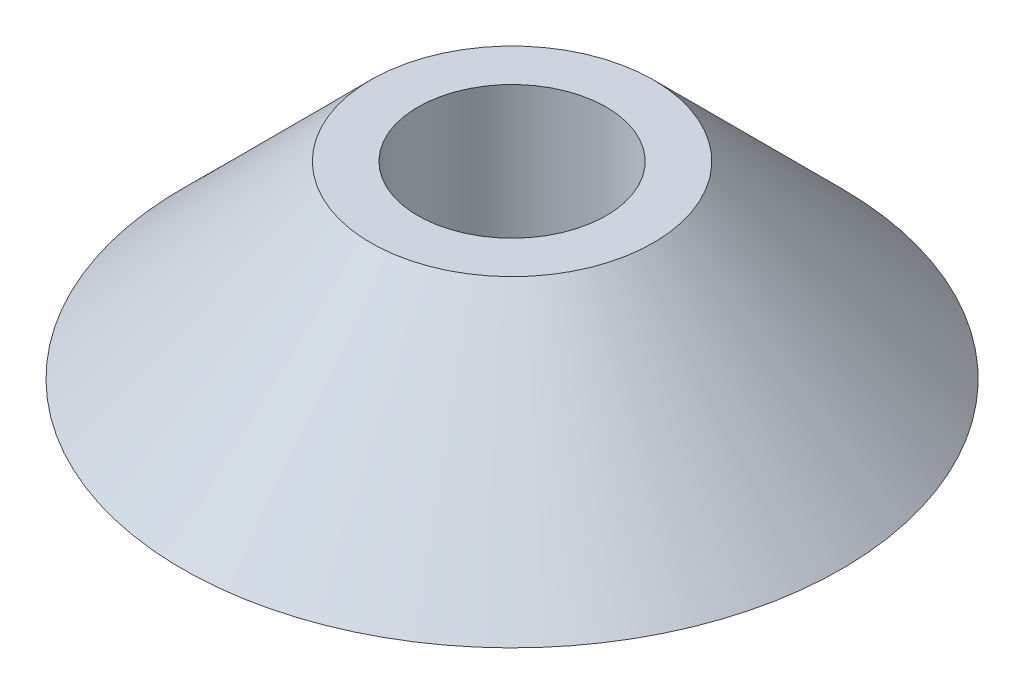
ISO-10303-21;
HEADER;
FILE_DESCRIPTION(('STEP AP214'),'2;1');
FILE_NAME('part.step','',(''),(''),'','','');
FILE_SCHEMA(('AUTOMOTIVE_DESIGN { 1 0 10303 214 1 1 1 1 }'));
ENDSEC;
DATA;
#1=APPLICATION_CONTEXT('core data for automotive mechanical design processes');
#2=APPLICATION_PROTOCOL_DEFINITION('international standard','automotive_design',2000,#1);
#3=PRODUCT_CONTEXT('',#1,'mechanical');
#4=PRODUCT('Part','Part','',(#3));
#5=PRODUCT_RELATED_PRODUCT_CATEGORY('part','',(#4));
#6=PRODUCT_DEFINITION_FORMATION('','',#4);
#7=PRODUCT_DEFINITION_CONTEXT('part definition',#1,'design');
#8=PRODUCT_DEFINITION('design','',#6,#7);
#9=PRODUCT_DEFINITION_SHAPE('','',#8);
#10=(LENGTH_UNIT() NAMED_UNIT(*) SI_UNIT(.MILLI.,.METRE.));
#11=(NAMED_UNIT(*) PLANE_ANGLE_UNIT() SI_UNIT($,.RADIAN.));
#12=(NAMED_UNIT(*) SI_UNIT($,.STERADIAN.) SOLID_ANGLE_UNIT());
#13=UNCERTAINTY_MEASURE_WITH_UNIT(LENGTH_MEASURE(1.E-05),#10,'distance_accuracy_value','');
#14=(GEOMETRIC_REPRESENTATION_CONTEXT(3) GLOBAL_UNCERTAINTY_ASSIGNED_CONTEXT((#13)) GLOBAL_UNIT_ASSIGNED_CONTEXT((#10,
#11,#12)) REPRESENTATION_CONTEXT('',''));
#15=CARTESIAN_POINT('',(0.,0.,0.));
#16=DIRECTION('',(0.,0.,1.));
#17=DIRECTION('',(1.,0.,0.));
#18=AXIS2_PLACEMENT_3D('',#15,#16,#17);
#19=CARTESIAN_POINT('',(0.,0.,0.));
#20=DIRECTION('',(0.,-1.,0.));
#21=DIRECTION('',(0.,0.,-1.));
#22=AXIS2_PLACEMENT_3D('',#19,#20,#21);
#23=CONICAL_SURFACE('',#22,22.2250000000001,0.785398163397454);
#24=CARTESIAN_POINT('',(0.,12.6999999999999,0.));
#25=DIRECTION('',(0.,-1.,0.));
#26=DIRECTION('',(0.,0.,-1.));
#27=AXIS2_PLACEMENT_3D('',#24,#25,#26);
#28=CIRCLE('',#27,9.525);
#29=CARTESIAN_POINT('',(0.,12.6999999999999,-9.525));
#30=VERTEX_POINT('',#29);
#31=EDGE_CURVE('E10',#30,#30,#28,.T.);
#32=ORIENTED_EDGE('',*,*,#31,.T.);
#33=EDGE_LOOP('',(#32));
#34=FACE_BOUND('',#33,.T.);
#35=CARTESIAN_POINT('',(0.,0.,0.));
#36=DIRECTION('',(0.,-1.,0.));
#37=DIRECTION('',(0.,0.,-1.));
#38=AXIS2_PLACEMENT_3D('',#35,#36,#37);
#39=CIRCLE('',#38,22.2250000000001);
#40=CARTESIAN_POINT('',(0.,0.,-22.2250000000001));
#41=VERTEX_POINT('',#40);
#42=EDGE_CURVE('E44',#41,#41,#39,.T.);
#43=ORIENTED_EDGE('',*,*,#42,.F.);
#44=EDGE_LOOP('',(#43));
#45=FACE_BOUND('',#44,.T.);
#46=ADVANCED_FACE('F30',(#34,#45),#23,.T.);
#47=CARTESIAN_POINT('',(9.525,12.7,0.));
#48=DIRECTION('',(0.,1.,0.));
#49=DIRECTION('',(0.,0.,1.));
#50=AXIS2_PLACEMENT_3D('',#47,#48,#49);
#51=PLANE('',#50);
#52=CARTESIAN_POINT('',(0.,12.6999999999999,0.));
#53=DIRECTION('',(0.,-1.,0.));
#54=DIRECTION('',(0.,0.,-1.));
#55=AXIS2_PLACEMENT_3D('',#52,#53,#54);
#56=CIRCLE('',#55,6.35);
#57=CARTESIAN_POINT('',(0.,12.6999999999999,-6.35));
#58=VERTEX_POINT('',#57);
#59=EDGE_CURVE('E36',#58,#58,#56,.T.);
#60=ORIENTED_EDGE('',*,*,#59,.T.);
#61=EDGE_LOOP('',(#60));
#62=FACE_BOUND('',#61,.T.);
#63=ORIENTED_EDGE('',*,*,#31,.F.);
#64=EDGE_LOOP('',(#63));
#65=FACE_BOUND('',#64,.T.);
#66=ADVANCED_FACE('F54',(#62,#65),#51,.T.);
#67=CARTESIAN_POINT('',(0.,-1000.69375591004,0.));
#68=DIRECTION('',(0.,-1.,0.));
#69=DIRECTION('',(0.,0.,-1.));
#70=AXIS2_PLACEMENT_3D('',#67,#68,#69);
#71=CYLINDRICAL_SURFACE('',#70,6.35);
#72=CARTESIAN_POINT('',(0.,0.,0.));
#73=DIRECTION('',(0.,-1.,0.));
#74=DIRECTION('',(0.,0.,-1.));
#75=AXIS2_PLACEMENT_3D('',#72,#73,#74);
#76=CIRCLE('',#75,6.35);
#77=CARTESIAN_POINT('',(0.,0.,-6.35));
#78=VERTEX_POINT('',#77);
#79=EDGE_CURVE('E40',#78,#78,#76,.T.);
#80=ORIENTED_EDGE('',*,*,#79,.T.);
#81=EDGE_LOOP('',(#80));
#82=FACE_BOUND('',#81,.T.);
#83=ORIENTED_EDGE('',*,*,#59,.F.);
#84=EDGE_LOOP('',(#83));
#85=FACE_BOUND('',#84,.T.);
#86=ADVANCED_FACE('F58',(#82,#85),#71,.F.);
#87=CARTESIAN_POINT('',(6.35,0.,0.));
#88=DIRECTION('',(0.,-1.,0.));
#89=DIRECTION('',(0.,0.,-1.));
#90=AXIS2_PLACEMENT_3D('',#87,#88,#89);
#91=PLANE('',#90);
#92=ORIENTED_EDGE('',*,*,#42,.T.);
#93=EDGE_LOOP('',(#92));
#94=FACE_BOUND('',#93,.T.);
#95=ORIENTED_EDGE('',*,*,#79,.F.);
#96=EDGE_LOOP('',(#95));
#97=FACE_BOUND('',#96,.T.);
#98=ADVANCED_FACE('F50',(#94,#97),#91,.T.);
#99=CLOSED_SHELL('',(#46,#66,#86,#98));
#100=MANIFOLD_SOLID_BREP('B2',#99);
#101=ADVANCED_BREP_SHAPE_REPRESENTATION('',(#18,#100),#14);
#102=SHAPE_DEFINITION_REPRESENTATION(#9,#101);
ENDSEC;
END-ISO-10303-21;
